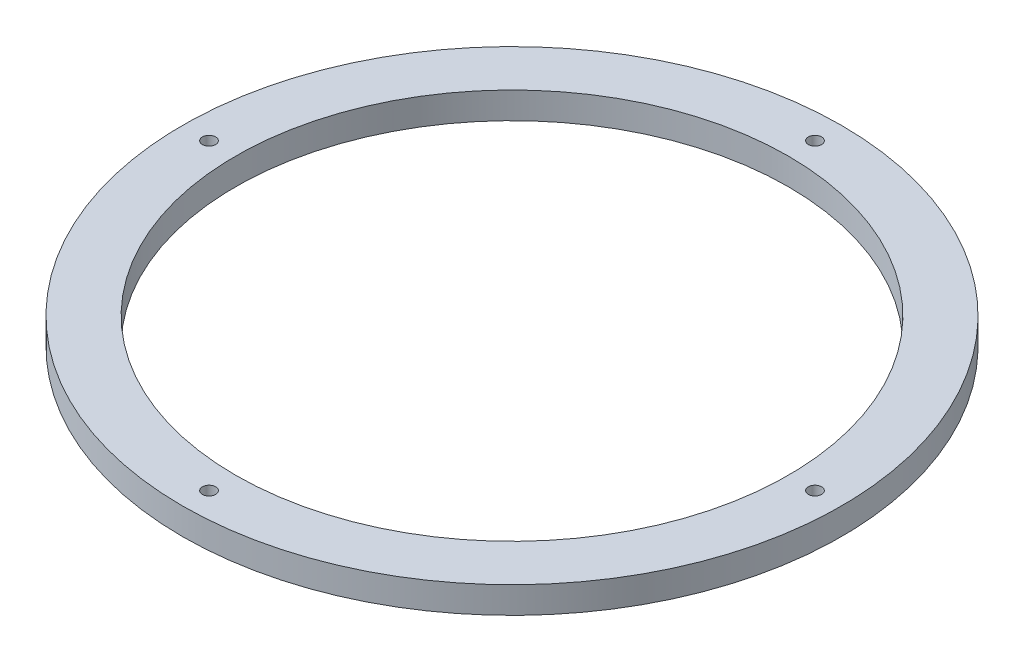
ISO-10303-21;
HEADER;
FILE_DESCRIPTION(('STEP AP214'),'2;1');
FILE_NAME('part.step','',(''),(''),'','','');
FILE_SCHEMA(('AUTOMOTIVE_DESIGN { 1 0 10303 214 1 1 1 1 }'));
ENDSEC;
DATA;
#1=APPLICATION_CONTEXT('core data for automotive mechanical design processes');
#2=APPLICATION_PROTOCOL_DEFINITION('international standard','automotive_design',2000,#1);
#3=PRODUCT_CONTEXT('',#1,'mechanical');
#4=PRODUCT('Part','Part','',(#3));
#5=PRODUCT_RELATED_PRODUCT_CATEGORY('part','',(#4));
#6=PRODUCT_DEFINITION_FORMATION('','',#4);
#7=PRODUCT_DEFINITION_CONTEXT('part definition',#1,'design');
#8=PRODUCT_DEFINITION('design','',#6,#7);
#9=PRODUCT_DEFINITION_SHAPE('','',#8);
#10=(LENGTH_UNIT() NAMED_UNIT(*) SI_UNIT(.MILLI.,.METRE.));
#11=(NAMED_UNIT(*) PLANE_ANGLE_UNIT() SI_UNIT($,.RADIAN.));
#12=(NAMED_UNIT(*) SI_UNIT($,.STERADIAN.) SOLID_ANGLE_UNIT());
#13=UNCERTAINTY_MEASURE_WITH_UNIT(LENGTH_MEASURE(1.E-05),#10,'distance_accuracy_value','');
#14=(GEOMETRIC_REPRESENTATION_CONTEXT(3) GLOBAL_UNCERTAINTY_ASSIGNED_CONTEXT((#13)) GLOBAL_UNIT_ASSIGNED_CONTEXT((#10,
#11,#12)) REPRESENTATION_CONTEXT('',''));
#15=CARTESIAN_POINT('',(0.,0.,0.));
#16=DIRECTION('',(0.,0.,1.));
#17=DIRECTION('',(1.,0.,0.));
#18=AXIS2_PLACEMENT_3D('',#15,#16,#17);
#19=CARTESIAN_POINT('',(0.,3.175,0.));
#20=DIRECTION('',(0.,1.,0.));
#21=DIRECTION('',(0.,0.,1.));
#22=AXIS2_PLACEMENT_3D('',#19,#20,#21);
#23=PLANE('',#22);
#24=CARTESIAN_POINT('',(-36.195,3.175,-2.52748334118854E-13));
#25=DIRECTION('',(0.,1.,0.));
#26=DIRECTION('',(0.,0.,1.));
#27=AXIS2_PLACEMENT_3D('',#24,#25,#26);
#28=CIRCLE('',#27,0.79375);
#29=CARTESIAN_POINT('',(-36.195,3.175,0.793749999999747));
#30=VERTEX_POINT('',#29);
#31=EDGE_CURVE('E59',#30,#30,#28,.T.);
#32=ORIENTED_EDGE('',*,*,#31,.F.);
#33=EDGE_LOOP('',(#32));
#34=FACE_BOUND('',#33,.T.);
#35=CARTESIAN_POINT('',(36.195,3.175,0.));
#36=DIRECTION('',(0.,1.,0.));
#37=DIRECTION('',(0.,0.,1.));
#38=AXIS2_PLACEMENT_3D('',#35,#36,#37);
#39=CIRCLE('',#38,0.79375);
#40=CARTESIAN_POINT('',(36.195,3.175,0.79375));
#41=VERTEX_POINT('',#40);
#42=EDGE_CURVE('E47',#41,#41,#39,.T.);
#43=ORIENTED_EDGE('',*,*,#42,.F.);
#44=EDGE_LOOP('',(#43));
#45=FACE_BOUND('',#44,.T.);
#46=CARTESIAN_POINT('',(0.,3.175,0.));
#47=DIRECTION('',(0.,1.,0.));
#48=DIRECTION('',(0.,0.,1.));
#49=AXIS2_PLACEMENT_3D('',#46,#47,#48);
#50=CIRCLE('',#49,39.37);
#51=CARTESIAN_POINT('',(0.,3.175,39.37));
#52=VERTEX_POINT('',#51);
#53=EDGE_CURVE('E10',#52,#52,#50,.T.);
#54=ORIENTED_EDGE('',*,*,#53,.T.);
#55=EDGE_LOOP('',(#54));
#56=FACE_BOUND('',#55,.T.);
#57=CARTESIAN_POINT('',(0.,3.175,0.));
#58=DIRECTION('',(0.,1.,0.));
#59=DIRECTION('',(0.,0.,1.));
#60=AXIS2_PLACEMENT_3D('',#57,#58,#59);
#61=CIRCLE('',#60,33.02);
#62=CARTESIAN_POINT('',(0.,3.175,33.02));
#63=VERTEX_POINT('',#62);
#64=EDGE_CURVE('E42',#63,#63,#61,.T.);
#65=ORIENTED_EDGE('',*,*,#64,.F.);
#66=EDGE_LOOP('',(#65));
#67=FACE_BOUND('',#66,.T.);
#68=CARTESIAN_POINT('',(-1.26374167059427E-13,3.175,36.195));
#69=DIRECTION('',(0.,1.,0.));
#70=DIRECTION('',(0.,0.,1.));
#71=AXIS2_PLACEMENT_3D('',#68,#69,#70);
#72=CIRCLE('',#71,0.79375);
#73=CARTESIAN_POINT('',(-1.26374167059427E-13,3.175,36.98875));
#74=VERTEX_POINT('',#73);
#75=EDGE_CURVE('E53',#74,#74,#72,.T.);
#76=ORIENTED_EDGE('',*,*,#75,.F.);
#77=EDGE_LOOP('',(#76));
#78=FACE_BOUND('',#77,.T.);
#79=CARTESIAN_POINT('',(3.79122501178282E-13,3.175,-36.195));
#80=DIRECTION('',(0.,1.,0.));
#81=DIRECTION('',(0.,0.,1.));
#82=AXIS2_PLACEMENT_3D('',#79,#80,#81);
#83=CIRCLE('',#82,0.79375);
#84=CARTESIAN_POINT('',(3.79122501178282E-13,3.175,-35.40125));
#85=VERTEX_POINT('',#84);
#86=EDGE_CURVE('E65',#85,#85,#83,.T.);
#87=ORIENTED_EDGE('',*,*,#86,.F.);
#88=EDGE_LOOP('',(#87));
#89=FACE_BOUND('',#88,.T.);
#90=ADVANCED_FACE('F31',(#34,#45,#56,#67,#78,#89),#23,.T.);
#91=CARTESIAN_POINT('',(0.,0.,0.));
#92=DIRECTION('',(0.,1.,0.));
#93=DIRECTION('',(0.,0.,1.));
#94=AXIS2_PLACEMENT_3D('',#91,#92,#93);
#95=PLANE('',#94);
#96=CARTESIAN_POINT('',(-36.195,0.,-2.52748334118854E-13));
#97=DIRECTION('',(0.,1.,0.));
#98=DIRECTION('',(0.,0.,1.));
#99=AXIS2_PLACEMENT_3D('',#96,#97,#98);
#100=CIRCLE('',#99,0.79375);
#101=CARTESIAN_POINT('',(-36.195,0.,0.793749999999747));
#102=VERTEX_POINT('',#101);
#103=EDGE_CURVE('E62',#102,#102,#100,.T.);
#104=ORIENTED_EDGE('',*,*,#103,.T.);
#105=EDGE_LOOP('',(#104));
#106=FACE_BOUND('',#105,.T.);
#107=CARTESIAN_POINT('',(36.195,0.,0.));
#108=DIRECTION('',(0.,1.,0.));
#109=DIRECTION('',(0.,0.,1.));
#110=AXIS2_PLACEMENT_3D('',#107,#108,#109);
#111=CIRCLE('',#110,0.79375);
#112=CARTESIAN_POINT('',(36.195,0.,0.79375));
#113=VERTEX_POINT('',#112);
#114=EDGE_CURVE('E50',#113,#113,#111,.T.);
#115=ORIENTED_EDGE('',*,*,#114,.T.);
#116=EDGE_LOOP('',(#115));
#117=FACE_BOUND('',#116,.T.);
#118=CARTESIAN_POINT('',(0.,0.,0.));
#119=DIRECTION('',(0.,1.,0.));
#120=DIRECTION('',(0.,0.,1.));
#121=AXIS2_PLACEMENT_3D('',#118,#119,#120);
#122=CIRCLE('',#121,39.37);
#123=CARTESIAN_POINT('',(0.,0.,39.37));
#124=VERTEX_POINT('',#123);
#125=EDGE_CURVE('E35',#124,#124,#122,.T.);
#126=ORIENTED_EDGE('',*,*,#125,.F.);
#127=EDGE_LOOP('',(#126));
#128=FACE_BOUND('',#127,.T.);
#129=CARTESIAN_POINT('',(0.,0.,0.));
#130=DIRECTION('',(0.,1.,0.));
#131=DIRECTION('',(0.,0.,1.));
#132=AXIS2_PLACEMENT_3D('',#129,#130,#131);
#133=CIRCLE('',#132,33.02);
#134=CARTESIAN_POINT('',(0.,0.,33.02));
#135=VERTEX_POINT('',#134);
#136=EDGE_CURVE('E44',#135,#135,#133,.T.);
#137=ORIENTED_EDGE('',*,*,#136,.T.);
#138=EDGE_LOOP('',(#137));
#139=FACE_BOUND('',#138,.T.);
#140=CARTESIAN_POINT('',(-1.26374167059427E-13,0.,36.195));
#141=DIRECTION('',(0.,1.,0.));
#142=DIRECTION('',(0.,0.,1.));
#143=AXIS2_PLACEMENT_3D('',#140,#141,#142);
#144=CIRCLE('',#143,0.79375);
#145=CARTESIAN_POINT('',(-1.26374167059427E-13,0.,36.98875));
#146=VERTEX_POINT('',#145);
#147=EDGE_CURVE('E56',#146,#146,#144,.T.);
#148=ORIENTED_EDGE('',*,*,#147,.T.);
#149=EDGE_LOOP('',(#148));
#150=FACE_BOUND('',#149,.T.);
#151=CARTESIAN_POINT('',(3.79122501178282E-13,0.,-36.195));
#152=DIRECTION('',(0.,1.,0.));
#153=DIRECTION('',(0.,0.,1.));
#154=AXIS2_PLACEMENT_3D('',#151,#152,#153);
#155=CIRCLE('',#154,0.79375);
#156=CARTESIAN_POINT('',(3.79122501178282E-13,0.,-35.40125));
#157=VERTEX_POINT('',#156);
#158=EDGE_CURVE('E68',#157,#157,#155,.T.);
#159=ORIENTED_EDGE('',*,*,#158,.T.);
#160=EDGE_LOOP('',(#159));
#161=FACE_BOUND('',#160,.T.);
#162=ADVANCED_FACE('F78',(#106,#117,#128,#139,#150,#161),#95,.F.);
#163=CARTESIAN_POINT('',(0.,3.175,0.));
#164=DIRECTION('',(0.,-1.,0.));
#165=DIRECTION('',(0.,0.,-1.));
#166=AXIS2_PLACEMENT_3D('',#163,#164,#165);
#167=CYLINDRICAL_SURFACE('',#166,39.37);
#168=ORIENTED_EDGE('',*,*,#53,.F.);
#169=EDGE_LOOP('',(#168));
#170=FACE_BOUND('',#169,.T.);
#171=ORIENTED_EDGE('',*,*,#125,.T.);
#172=EDGE_LOOP('',(#171));
#173=FACE_BOUND('',#172,.T.);
#174=ADVANCED_FACE('F33',(#170,#173),#167,.T.);
#175=CARTESIAN_POINT('',(0.,3.175,0.));
#176=DIRECTION('',(0.,-1.,0.));
#177=DIRECTION('',(0.,0.,-1.));
#178=AXIS2_PLACEMENT_3D('',#175,#176,#177);
#179=CYLINDRICAL_SURFACE('',#178,33.02);
#180=ORIENTED_EDGE('',*,*,#64,.T.);
#181=EDGE_LOOP('',(#180));
#182=FACE_BOUND('',#181,.T.);
#183=ORIENTED_EDGE('',*,*,#136,.F.);
#184=EDGE_LOOP('',(#183));
#185=FACE_BOUND('',#184,.T.);
#186=ADVANCED_FACE('F88',(#182,#185),#179,.F.);
#187=CARTESIAN_POINT('',(36.195,3.175,0.));
#188=DIRECTION('',(0.,-1.,0.));
#189=DIRECTION('',(0.,0.,-1.));
#190=AXIS2_PLACEMENT_3D('',#187,#188,#189);
#191=CYLINDRICAL_SURFACE('',#190,0.79375);
#192=ORIENTED_EDGE('',*,*,#42,.T.);
#193=EDGE_LOOP('',(#192));
#194=FACE_BOUND('',#193,.T.);
#195=ORIENTED_EDGE('',*,*,#114,.F.);
#196=EDGE_LOOP('',(#195));
#197=FACE_BOUND('',#196,.T.);
#198=ADVANCED_FACE('F91',(#194,#197),#191,.F.);
#199=CARTESIAN_POINT('',(-1.26374167059427E-13,3.175,36.195));
#200=DIRECTION('',(0.,-1.,0.));
#201=DIRECTION('',(0.,0.,-1.));
#202=AXIS2_PLACEMENT_3D('',#199,#200,#201);
#203=CYLINDRICAL_SURFACE('',#202,0.79375);
#204=ORIENTED_EDGE('',*,*,#75,.T.);
#205=EDGE_LOOP('',(#204));
#206=FACE_BOUND('',#205,.T.);
#207=ORIENTED_EDGE('',*,*,#147,.F.);
#208=EDGE_LOOP('',(#207));
#209=FACE_BOUND('',#208,.T.);
#210=ADVANCED_FACE('F95',(#206,#209),#203,.F.);
#211=CARTESIAN_POINT('',(-36.195,3.175,-2.52748334118854E-13));
#212=DIRECTION('',(0.,-1.,0.));
#213=DIRECTION('',(0.,0.,-1.));
#214=AXIS2_PLACEMENT_3D('',#211,#212,#213);
#215=CYLINDRICAL_SURFACE('',#214,0.79375);
#216=ORIENTED_EDGE('',*,*,#31,.T.);
#217=EDGE_LOOP('',(#216));
#218=FACE_BOUND('',#217,.T.);
#219=ORIENTED_EDGE('',*,*,#103,.F.);
#220=EDGE_LOOP('',(#219));
#221=FACE_BOUND('',#220,.T.);
#222=ADVANCED_FACE('F99',(#218,#221),#215,.F.);
#223=CARTESIAN_POINT('',(3.79122501178282E-13,3.175,-36.195));
#224=DIRECTION('',(0.,-1.,0.));
#225=DIRECTION('',(0.,0.,-1.));
#226=AXIS2_PLACEMENT_3D('',#223,#224,#225);
#227=CYLINDRICAL_SURFACE('',#226,0.79375);
#228=ORIENTED_EDGE('',*,*,#86,.T.);
#229=EDGE_LOOP('',(#228));
#230=FACE_BOUND('',#229,.T.);
#231=ORIENTED_EDGE('',*,*,#158,.F.);
#232=EDGE_LOOP('',(#231));
#233=FACE_BOUND('',#232,.T.);
#234=ADVANCED_FACE('F74',(#230,#233),#227,.F.);
#235=CLOSED_SHELL('',(#90,#162,#174,#186,#198,#210,#222,#234));
#236=MANIFOLD_SOLID_BREP('B2',#235);
#237=ADVANCED_BREP_SHAPE_REPRESENTATION('',(#18,#236),#14);
#238=SHAPE_DEFINITION_REPRESENTATION(#9,#237);
ENDSEC;
END-ISO-10303-21;
